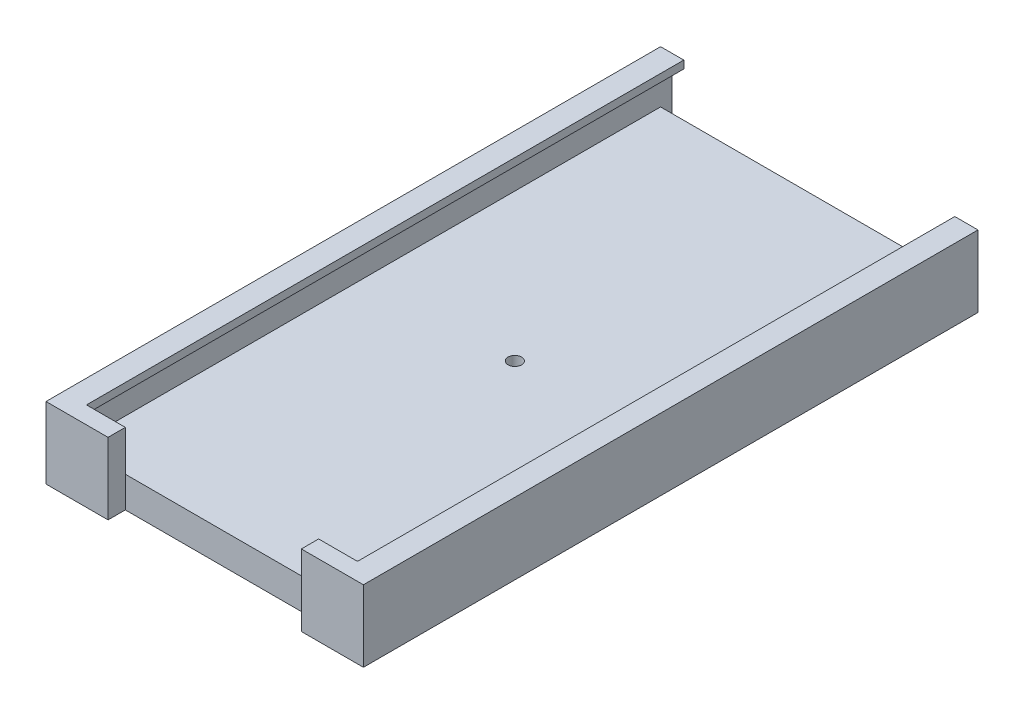
ISO-10303-21;
HEADER;
FILE_DESCRIPTION(('STEP AP214'),'2;1');
FILE_NAME('part.step','',(''),(''),'','','');
FILE_SCHEMA(('AUTOMOTIVE_DESIGN { 1 0 10303 214 1 1 1 1 }'));
ENDSEC;
DATA;
#1=APPLICATION_CONTEXT('core data for automotive mechanical design processes');
#2=APPLICATION_PROTOCOL_DEFINITION('international standard','automotive_design',2000,#1);
#3=PRODUCT_CONTEXT('',#1,'mechanical');
#4=PRODUCT('Part','Part','',(#3));
#5=PRODUCT_RELATED_PRODUCT_CATEGORY('part','',(#4));
#6=PRODUCT_DEFINITION_FORMATION('','',#4);
#7=PRODUCT_DEFINITION_CONTEXT('part definition',#1,'design');
#8=PRODUCT_DEFINITION('design','',#6,#7);
#9=PRODUCT_DEFINITION_SHAPE('','',#8);
#10=(LENGTH_UNIT() NAMED_UNIT(*) SI_UNIT(.MILLI.,.METRE.));
#11=(NAMED_UNIT(*) PLANE_ANGLE_UNIT() SI_UNIT($,.RADIAN.));
#12=(NAMED_UNIT(*) SI_UNIT($,.STERADIAN.) SOLID_ANGLE_UNIT());
#13=UNCERTAINTY_MEASURE_WITH_UNIT(LENGTH_MEASURE(1.E-05),#10,'distance_accuracy_value','');
#14=(GEOMETRIC_REPRESENTATION_CONTEXT(3) GLOBAL_UNCERTAINTY_ASSIGNED_CONTEXT((#13)) GLOBAL_UNIT_ASSIGNED_CONTEXT((#10,
#11,#12)) REPRESENTATION_CONTEXT('',''));
#15=CARTESIAN_POINT('',(0.,0.,0.));
#16=DIRECTION('',(0.,0.,1.));
#17=DIRECTION('',(1.,0.,0.));
#18=AXIS2_PLACEMENT_3D('',#15,#16,#17);
#19=CARTESIAN_POINT('',(0.,18.5,151.5));
#20=DIRECTION('',(0.,0.,1.));
#21=DIRECTION('',(1.,0.,0.));
#22=AXIS2_PLACEMENT_3D('',#19,#20,#21);
#23=PLANE('',#22);
#24=DIRECTION('',(1.,0.,0.));
#25=VECTOR('',#24,1.);
#26=CARTESIAN_POINT('',(73.1,16.5,151.5));
#27=LINE('',#26,#25);
#28=CARTESIAN_POINT('',(73.1,16.5,151.5));
#29=VERTEX_POINT('',#28);
#30=CARTESIAN_POINT('',(76.1,16.5,151.5));
#31=VERTEX_POINT('',#30);
#32=EDGE_CURVE('E118',#29,#31,#27,.T.);
#33=ORIENTED_EDGE('',*,*,#32,.T.);
#34=DIRECTION('',(0.,-1.,0.));
#35=VECTOR('',#34,1.);
#36=CARTESIAN_POINT('',(76.1,18.5,151.5));
#37=LINE('',#36,#35);
#38=CARTESIAN_POINT('',(76.1,8.,151.5));
#39=VERTEX_POINT('',#38);
#40=EDGE_CURVE('E347',#31,#39,#37,.T.);
#41=ORIENTED_EDGE('',*,*,#40,.T.);
#42=DIRECTION('',(1.,0.,0.));
#43=VECTOR('',#42,1.);
#44=CARTESIAN_POINT('',(0.,8.,151.5));
#45=LINE('',#44,#43);
#46=CARTESIAN_POINT('',(63.05,8.,151.5));
#47=VERTEX_POINT('',#46);
#48=EDGE_CURVE('E364',#47,#39,#45,.T.);
#49=ORIENTED_EDGE('',*,*,#48,.F.);
#50=DIRECTION('',(0.,-1.,0.));
#51=VECTOR('',#50,1.);
#52=CARTESIAN_POINT('',(63.05,24.5,151.5));
#53=LINE('',#52,#51);
#54=CARTESIAN_POINT('',(63.05,18.5,151.5));
#55=VERTEX_POINT('',#54);
#56=EDGE_CURVE('E308',#55,#47,#53,.T.);
#57=ORIENTED_EDGE('',*,*,#56,.F.);
#58=DIRECTION('',(-1.,0.,0.));
#59=VECTOR('',#58,1.);
#60=CARTESIAN_POINT('',(0.,18.5,151.5));
#61=LINE('',#60,#59);
#62=CARTESIAN_POINT('',(73.1,18.5,151.5));
#63=VERTEX_POINT('',#62);
#64=EDGE_CURVE('E239',#63,#55,#61,.T.);
#65=ORIENTED_EDGE('',*,*,#64,.F.);
#66=DIRECTION('',(0.,1.,0.));
#67=VECTOR('',#66,1.);
#68=CARTESIAN_POINT('',(73.1,18.5,151.5));
#69=LINE('',#68,#67);
#70=EDGE_CURVE('E113',#29,#63,#69,.T.);
#71=ORIENTED_EDGE('',*,*,#70,.F.);
#72=EDGE_LOOP('',(#33,#41,#49,#57,#65,#71));
#73=FACE_BOUND('',#72,.T.);
#74=ADVANCED_FACE('F97',(#73),#23,.F.);
#75=CARTESIAN_POINT('',(76.1,18.5,0.));
#76=DIRECTION('',(-1.,0.,0.));
#77=DIRECTION('',(0.,0.,1.));
#78=AXIS2_PLACEMENT_3D('',#75,#76,#77);
#79=PLANE('',#78);
#80=ORIENTED_EDGE('',*,*,#40,.F.);
#81=DIRECTION('',(0.,0.,1.));
#82=VECTOR('',#81,1.);
#83=CARTESIAN_POINT('',(76.1,16.5,151.5));
#84=LINE('',#83,#82);
#85=CARTESIAN_POINT('',(76.1,16.5,-3.));
#86=VERTEX_POINT('',#85);
#87=EDGE_CURVE('E256',#86,#31,#84,.T.);
#88=ORIENTED_EDGE('',*,*,#87,.F.);
#89=DIRECTION('',(0.,1.,0.));
#90=VECTOR('',#89,1.);
#91=CARTESIAN_POINT('',(76.1,2.,-3.));
#92=LINE('',#91,#90);
#93=CARTESIAN_POINT('',(76.1,2.,-3.));
#94=VERTEX_POINT('',#93);
#95=EDGE_CURVE('E293',#94,#86,#92,.T.);
#96=ORIENTED_EDGE('',*,*,#95,.F.);
#97=DIRECTION('',(0.,0.,-1.));
#98=VECTOR('',#97,1.);
#99=CARTESIAN_POINT('',(76.1,2.,0.));
#100=LINE('',#99,#98);
#101=CARTESIAN_POINT('',(76.1,2.,0.));
#102=VERTEX_POINT('',#101);
#103=EDGE_CURVE('E289',#102,#94,#100,.T.);
#104=ORIENTED_EDGE('',*,*,#103,.F.);
#105=DIRECTION('',(0.,1.,0.));
#106=VECTOR('',#105,1.);
#107=CARTESIAN_POINT('',(76.1,2.,0.));
#108=LINE('',#107,#106);
#109=CARTESIAN_POINT('',(76.1,8.,0.));
#110=VERTEX_POINT('',#109);
#111=EDGE_CURVE('E296',#102,#110,#108,.T.);
#112=ORIENTED_EDGE('',*,*,#111,.T.);
#113=DIRECTION('',(0.,0.,1.));
#114=VECTOR('',#113,1.);
#115=CARTESIAN_POINT('',(76.1,8.,0.));
#116=LINE('',#115,#114);
#117=EDGE_CURVE('E354',#110,#39,#116,.T.);
#118=ORIENTED_EDGE('',*,*,#117,.T.);
#119=EDGE_LOOP('',(#80,#88,#96,#104,#112,#118));
#120=FACE_BOUND('',#119,.T.);
#121=ADVANCED_FACE('F437',(#120),#79,.T.);
#122=CARTESIAN_POINT('',(0.,18.5,0.));
#123=DIRECTION('',(1.,0.,0.));
#124=DIRECTION('',(0.,0.,-1.));
#125=AXIS2_PLACEMENT_3D('',#122,#123,#124);
#126=PLANE('',#125);
#127=DIRECTION('',(0.,1.,0.));
#128=VECTOR('',#127,1.);
#129=CARTESIAN_POINT('',(0.,2.,-3.));
#130=LINE('',#129,#128);
#131=CARTESIAN_POINT('',(0.,2.,-3.));
#132=VERTEX_POINT('',#131);
#133=CARTESIAN_POINT('',(0.,16.5,-3.));
#134=VERTEX_POINT('',#133);
#135=EDGE_CURVE('E292',#132,#134,#130,.T.);
#136=ORIENTED_EDGE('',*,*,#135,.T.);
#137=DIRECTION('',(0.,0.,-1.));
#138=VECTOR('',#137,1.);
#139=CARTESIAN_POINT('',(0.,16.5,-3.));
#140=LINE('',#139,#138);
#141=CARTESIAN_POINT('',(0.,16.5,151.5));
#142=VERTEX_POINT('',#141);
#143=EDGE_CURVE('E262',#142,#134,#140,.T.);
#144=ORIENTED_EDGE('',*,*,#143,.F.);
#145=DIRECTION('',(0.,-1.,0.));
#146=VECTOR('',#145,1.);
#147=CARTESIAN_POINT('',(0.,18.5,151.5));
#148=LINE('',#147,#146);
#149=CARTESIAN_POINT('',(0.,8.,151.5));
#150=VERTEX_POINT('',#149);
#151=EDGE_CURVE('E331',#142,#150,#148,.T.);
#152=ORIENTED_EDGE('',*,*,#151,.T.);
#153=DIRECTION('',(0.,0.,1.));
#154=VECTOR('',#153,1.);
#155=CARTESIAN_POINT('',(0.,8.,0.));
#156=LINE('',#155,#154);
#157=CARTESIAN_POINT('',(0.,8.,0.));
#158=VERTEX_POINT('',#157);
#159=EDGE_CURVE('E361',#158,#150,#156,.T.);
#160=ORIENTED_EDGE('',*,*,#159,.F.);
#161=DIRECTION('',(0.,1.,0.));
#162=VECTOR('',#161,1.);
#163=CARTESIAN_POINT('',(0.,2.,0.));
#164=LINE('',#163,#162);
#165=CARTESIAN_POINT('',(0.,2.,0.));
#166=VERTEX_POINT('',#165);
#167=EDGE_CURVE('E299',#166,#158,#164,.T.);
#168=ORIENTED_EDGE('',*,*,#167,.F.);
#169=DIRECTION('',(0.,0.,-1.));
#170=VECTOR('',#169,1.);
#171=CARTESIAN_POINT('',(0.,2.,0.));
#172=LINE('',#171,#170);
#173=EDGE_CURVE('E285',#166,#132,#172,.T.);
#174=ORIENTED_EDGE('',*,*,#173,.T.);
#175=EDGE_LOOP('',(#136,#144,#152,#160,#168,#174));
#176=FACE_BOUND('',#175,.T.);
#177=ADVANCED_FACE('F442',(#176),#126,.T.);
#178=DIRECTION('',(-1.,0.,0.));
#179=VECTOR('',#178,1.);
#180=CARTESIAN_POINT('',(3.00000000000002,16.5,151.5));
#181=LINE('',#180,#179);
#182=CARTESIAN_POINT('',(3.00000000000002,16.5,151.5));
#183=VERTEX_POINT('',#182);
#184=EDGE_CURVE('E279',#183,#142,#181,.T.);
#185=ORIENTED_EDGE('',*,*,#184,.F.);
#186=DIRECTION('',(0.,-1.,0.));
#187=VECTOR('',#186,1.);
#188=CARTESIAN_POINT('',(3.00000000000002,18.5,151.5));
#189=LINE('',#188,#187);
#190=CARTESIAN_POINT('',(3.00000000000002,18.5,151.5));
#191=VERTEX_POINT('',#190);
#192=EDGE_CURVE('E269',#191,#183,#189,.T.);
#193=ORIENTED_EDGE('',*,*,#192,.F.);
#194=CARTESIAN_POINT('',(13.05,18.5,151.5));
#195=VERTEX_POINT('',#194);
#196=EDGE_CURVE('E321',#195,#191,#61,.T.);
#197=ORIENTED_EDGE('',*,*,#196,.F.);
#198=DIRECTION('',(0.,-1.,0.));
#199=VECTOR('',#198,1.);
#200=CARTESIAN_POINT('',(13.05,24.5,151.5));
#201=LINE('',#200,#199);
#202=CARTESIAN_POINT('',(13.05,8.,151.5));
#203=VERTEX_POINT('',#202);
#204=EDGE_CURVE('E304',#195,#203,#201,.T.);
#205=ORIENTED_EDGE('',*,*,#204,.T.);
#206=EDGE_CURVE('E365',#150,#203,#45,.T.);
#207=ORIENTED_EDGE('',*,*,#206,.F.);
#208=ORIENTED_EDGE('',*,*,#151,.F.);
#209=EDGE_LOOP('',(#185,#193,#197,#205,#207,#208));
#210=FACE_BOUND('',#209,.T.);
#211=ADVANCED_FACE('F396',(#210),#23,.F.);
#212=CARTESIAN_POINT('',(0.,18.5,0.));
#213=DIRECTION('',(0.,1.,0.));
#214=DIRECTION('',(0.,0.,1.));
#215=AXIS2_PLACEMENT_3D('',#212,#213,#214);
#216=PLANE('',#215);
#217=DIRECTION('',(0.,0.,1.));
#218=VECTOR('',#217,1.);
#219=CARTESIAN_POINT('',(3.,18.5,-3.));
#220=LINE('',#219,#218);
#221=CARTESIAN_POINT('',(3.,18.5,-3.));
#222=VERTEX_POINT('',#221);
#223=EDGE_CURVE('E266',#222,#191,#220,.T.);
#224=ORIENTED_EDGE('',*,*,#223,.F.);
#225=DIRECTION('',(1.,0.,0.));
#226=VECTOR('',#225,1.);
#227=CARTESIAN_POINT('',(0.,18.5,-3.));
#228=LINE('',#227,#226);
#229=CARTESIAN_POINT('',(-3.,18.5,-3.));
#230=VERTEX_POINT('',#229);
#231=EDGE_CURVE('E238',#230,#222,#228,.T.);
#232=ORIENTED_EDGE('',*,*,#231,.F.);
#233=DIRECTION('',(0.,0.,1.));
#234=VECTOR('',#233,1.);
#235=CARTESIAN_POINT('',(-2.99999999999998,18.5,0.));
#236=LINE('',#235,#234);
#237=CARTESIAN_POINT('',(-2.99999999999998,18.5,155.969932389917));
#238=VERTEX_POINT('',#237);
#239=EDGE_CURVE('E323',#230,#238,#236,.T.);
#240=ORIENTED_EDGE('',*,*,#239,.T.);
#241=DIRECTION('',(-1.,0.,0.));
#242=VECTOR('',#241,1.);
#243=CARTESIAN_POINT('',(0.,18.5,155.969932389917));
#244=LINE('',#243,#242);
#245=CARTESIAN_POINT('',(13.05,18.5,155.969932389917));
#246=VERTEX_POINT('',#245);
#247=EDGE_CURVE('E326',#246,#238,#244,.T.);
#248=ORIENTED_EDGE('',*,*,#247,.F.);
#249=DIRECTION('',(0.,0.,1.));
#250=VECTOR('',#249,1.);
#251=CARTESIAN_POINT('',(13.05,18.5,0.));
#252=LINE('',#251,#250);
#253=EDGE_CURVE('E311',#195,#246,#252,.T.);
#254=ORIENTED_EDGE('',*,*,#253,.F.);
#255=ORIENTED_EDGE('',*,*,#196,.T.);
#256=EDGE_LOOP('',(#224,#232,#240,#248,#254,#255));
#257=FACE_BOUND('',#256,.T.);
#258=ADVANCED_FACE('F401',(#257),#216,.T.);
#259=CARTESIAN_POINT('',(0.,18.5,155.969932389917));
#260=DIRECTION('',(0.,0.,1.));
#261=DIRECTION('',(1.,0.,0.));
#262=AXIS2_PLACEMENT_3D('',#259,#260,#261);
#263=PLANE('',#262);
#264=DIRECTION('',(0.,1.,0.));
#265=VECTOR('',#264,1.);
#266=CARTESIAN_POINT('',(63.05,18.5,155.969932389917));
#267=LINE('',#266,#265);
#268=CARTESIAN_POINT('',(63.05,0.,155.969932389917));
#269=VERTEX_POINT('',#268);
#270=CARTESIAN_POINT('',(63.05,18.5,155.969932389917));
#271=VERTEX_POINT('',#270);
#272=EDGE_CURVE('E315',#269,#271,#267,.T.);
#273=ORIENTED_EDGE('',*,*,#272,.F.);
#274=DIRECTION('',(-1.,0.,0.));
#275=VECTOR('',#274,1.);
#276=CARTESIAN_POINT('',(0.,0.,155.969932389917));
#277=LINE('',#276,#275);
#278=CARTESIAN_POINT('',(79.1,0.,155.969932389917));
#279=VERTEX_POINT('',#278);
#280=EDGE_CURVE('E338',#279,#269,#277,.T.);
#281=ORIENTED_EDGE('',*,*,#280,.F.);
#282=DIRECTION('',(0.,-1.,0.));
#283=VECTOR('',#282,1.);
#284=CARTESIAN_POINT('',(79.1,18.5,155.969932389917));
#285=LINE('',#284,#283);
#286=CARTESIAN_POINT('',(79.1,18.5,155.969932389917));
#287=VERTEX_POINT('',#286);
#288=EDGE_CURVE('E346',#287,#279,#285,.T.);
#289=ORIENTED_EDGE('',*,*,#288,.F.);
#290=EDGE_CURVE('E327',#287,#271,#244,.T.);
#291=ORIENTED_EDGE('',*,*,#290,.T.);
#292=EDGE_LOOP('',(#273,#281,#289,#291));
#293=FACE_BOUND('',#292,.T.);
#294=ADVANCED_FACE('F424',(#293),#263,.T.);
#295=CARTESIAN_POINT('',(0.,8.,0.));
#296=DIRECTION('',(0.,1.,0.));
#297=DIRECTION('',(0.,0.,1.));
#298=AXIS2_PLACEMENT_3D('',#295,#296,#297);
#299=PLANE('',#298);
#300=CARTESIAN_POINT('',(38.05,8.,75.75));
#301=DIRECTION('',(0.,1.,0.));
#302=DIRECTION('',(0.,0.,1.));
#303=AXIS2_PLACEMENT_3D('',#300,#301,#302);
#304=CIRCLE('',#303,1.75);
#305=CARTESIAN_POINT('',(38.05,8.,77.5));
#306=VERTEX_POINT('',#305);
#307=EDGE_CURVE('E259',#306,#306,#304,.F.);
#308=ORIENTED_EDGE('',*,*,#307,.T.);
#309=EDGE_LOOP('',(#308));
#310=FACE_BOUND('',#309,.T.);
#311=ORIENTED_EDGE('',*,*,#117,.F.);
#312=DIRECTION('',(1.,0.,0.));
#313=VECTOR('',#312,1.);
#314=CARTESIAN_POINT('',(0.,8.,0.));
#315=LINE('',#314,#313);
#316=EDGE_CURVE('E359',#158,#110,#315,.T.);
#317=ORIENTED_EDGE('',*,*,#316,.F.);
#318=ORIENTED_EDGE('',*,*,#159,.T.);
#319=ORIENTED_EDGE('',*,*,#206,.T.);
#320=DIRECTION('',(-1.,0.,0.));
#321=VECTOR('',#320,1.);
#322=CARTESIAN_POINT('',(0.,8.,151.5));
#323=LINE('',#322,#321);
#324=EDGE_CURVE('E313',#47,#203,#323,.T.);
#325=ORIENTED_EDGE('',*,*,#324,.F.);
#326=ORIENTED_EDGE('',*,*,#48,.T.);
#327=EDGE_LOOP('',(#311,#317,#318,#319,#325,#326));
#328=FACE_BOUND('',#327,.T.);
#329=ADVANCED_FACE('F388',(#310,#328),#299,.T.);
#330=CARTESIAN_POINT('',(0.,18.5,-3.));
#331=DIRECTION('',(0.,0.,-1.));
#332=DIRECTION('',(-1.,0.,0.));
#333=AXIS2_PLACEMENT_3D('',#330,#331,#332);
#334=PLANE('',#333);
#335=ORIENTED_EDGE('',*,*,#95,.T.);
#336=DIRECTION('',(1.,0.,0.));
#337=VECTOR('',#336,1.);
#338=CARTESIAN_POINT('',(73.1,16.5,-3.));
#339=LINE('',#338,#337);
#340=CARTESIAN_POINT('',(73.1,16.5,-3.));
#341=VERTEX_POINT('',#340);
#342=EDGE_CURVE('E249',#341,#86,#339,.T.);
#343=ORIENTED_EDGE('',*,*,#342,.F.);
#344=DIRECTION('',(0.,-1.,0.));
#345=VECTOR('',#344,1.);
#346=CARTESIAN_POINT('',(73.1,18.5,-3.));
#347=LINE('',#346,#345);
#348=CARTESIAN_POINT('',(73.1,18.5,-3.));
#349=VERTEX_POINT('',#348);
#350=EDGE_CURVE('E243',#349,#341,#347,.T.);
#351=ORIENTED_EDGE('',*,*,#350,.F.);
#352=CARTESIAN_POINT('',(79.1,18.5,-3.));
#353=VERTEX_POINT('',#352);
#354=EDGE_CURVE('E228',#349,#353,#228,.T.);
#355=ORIENTED_EDGE('',*,*,#354,.T.);
#356=DIRECTION('',(0.,-1.,0.));
#357=VECTOR('',#356,1.);
#358=CARTESIAN_POINT('',(79.1,18.5,-3.));
#359=LINE('',#358,#357);
#360=CARTESIAN_POINT('',(79.1,0.,-3.));
#361=VERTEX_POINT('',#360);
#362=EDGE_CURVE('E344',#353,#361,#359,.T.);
#363=ORIENTED_EDGE('',*,*,#362,.T.);
#364=DIRECTION('',(1.,0.,0.));
#365=VECTOR('',#364,1.);
#366=CARTESIAN_POINT('',(0.,0.,-3.));
#367=LINE('',#366,#365);
#368=CARTESIAN_POINT('',(-3.,0.,-3.));
#369=VERTEX_POINT('',#368);
#370=EDGE_CURVE('E320',#369,#361,#367,.T.);
#371=ORIENTED_EDGE('',*,*,#370,.F.);
#372=DIRECTION('',(0.,-1.,0.));
#373=VECTOR('',#372,1.);
#374=CARTESIAN_POINT('',(-3.,18.5,-3.));
#375=LINE('',#374,#373);
#376=EDGE_CURVE('E352',#230,#369,#375,.T.);
#377=ORIENTED_EDGE('',*,*,#376,.F.);
#378=ORIENTED_EDGE('',*,*,#231,.T.);
#379=DIRECTION('',(0.,1.,0.));
#380=VECTOR('',#379,1.);
#381=CARTESIAN_POINT('',(3.,18.5,-3.));
#382=LINE('',#381,#380);
#383=CARTESIAN_POINT('',(3.,16.5,-3.));
#384=VERTEX_POINT('',#383);
#385=EDGE_CURVE('E263',#384,#222,#382,.T.);
#386=ORIENTED_EDGE('',*,*,#385,.F.);
#387=DIRECTION('',(-1.,0.,0.));
#388=VECTOR('',#387,1.);
#389=CARTESIAN_POINT('',(3.,16.5,-3.));
#390=LINE('',#389,#388);
#391=EDGE_CURVE('E274',#384,#134,#390,.T.);
#392=ORIENTED_EDGE('',*,*,#391,.T.);
#393=ORIENTED_EDGE('',*,*,#135,.F.);
#394=DIRECTION('',(-1.,0.,0.));
#395=VECTOR('',#394,1.);
#396=CARTESIAN_POINT('',(76.1,2.,-3.));
#397=LINE('',#396,#395);
#398=EDGE_CURVE('E282',#94,#132,#397,.T.);
#399=ORIENTED_EDGE('',*,*,#398,.F.);
#400=EDGE_LOOP('',(#335,#343,#351,#355,#363,#371,#377,#378,#386,#392,#393,#399));
#401=FACE_BOUND('',#400,.T.);
#402=ADVANCED_FACE('F247',(#401),#334,.T.);
#403=CARTESIAN_POINT('',(-2.99999999999998,18.5,0.));
#404=DIRECTION('',(1.,0.,0.));
#405=DIRECTION('',(0.,0.,-1.));
#406=AXIS2_PLACEMENT_3D('',#403,#404,#405);
#407=PLANE('',#406);
#408=DIRECTION('',(0.,0.,1.));
#409=VECTOR('',#408,1.);
#410=CARTESIAN_POINT('',(-2.99999999999998,0.,0.));
#411=LINE('',#410,#409);
#412=CARTESIAN_POINT('',(-2.99999999999998,0.,155.969932389917));
#413=VERTEX_POINT('',#412);
#414=EDGE_CURVE('E334',#369,#413,#411,.T.);
#415=ORIENTED_EDGE('',*,*,#414,.T.);
#416=DIRECTION('',(0.,-1.,0.));
#417=VECTOR('',#416,1.);
#418=CARTESIAN_POINT('',(-2.99999999999998,18.5,155.969932389917));
#419=LINE('',#418,#417);
#420=EDGE_CURVE('E349',#238,#413,#419,.T.);
#421=ORIENTED_EDGE('',*,*,#420,.F.);
#422=ORIENTED_EDGE('',*,*,#239,.F.);
#423=ORIENTED_EDGE('',*,*,#376,.T.);
#424=EDGE_LOOP('',(#415,#421,#422,#423));
#425=FACE_BOUND('',#424,.T.);
#426=ADVANCED_FACE('F414',(#425),#407,.F.);
#427=DIRECTION('',(0.,-1.,0.));
#428=VECTOR('',#427,1.);
#429=CARTESIAN_POINT('',(13.05,18.5,155.969932389917));
#430=LINE('',#429,#428);
#431=CARTESIAN_POINT('',(13.05,0.,155.969932389917));
#432=VERTEX_POINT('',#431);
#433=EDGE_CURVE('E309',#246,#432,#430,.T.);
#434=ORIENTED_EDGE('',*,*,#433,.F.);
#435=ORIENTED_EDGE('',*,*,#247,.T.);
#436=ORIENTED_EDGE('',*,*,#420,.T.);
#437=EDGE_CURVE('E337',#432,#413,#277,.T.);
#438=ORIENTED_EDGE('',*,*,#437,.F.);
#439=EDGE_LOOP('',(#434,#435,#436,#438));
#440=FACE_BOUND('',#439,.T.);
#441=ADVANCED_FACE('F418',(#440),#263,.T.);
#442=CARTESIAN_POINT('',(79.1,18.5,0.));
#443=DIRECTION('',(1.,0.,0.));
#444=DIRECTION('',(0.,0.,-1.));
#445=AXIS2_PLACEMENT_3D('',#442,#443,#444);
#446=PLANE('',#445);
#447=DIRECTION('',(0.,0.,1.));
#448=VECTOR('',#447,1.);
#449=CARTESIAN_POINT('',(79.1,0.,0.));
#450=LINE('',#449,#448);
#451=EDGE_CURVE('E341',#361,#279,#450,.T.);
#452=ORIENTED_EDGE('',*,*,#451,.F.);
#453=ORIENTED_EDGE('',*,*,#362,.F.);
#454=DIRECTION('',(0.,0.,1.));
#455=VECTOR('',#454,1.);
#456=CARTESIAN_POINT('',(79.1,18.5,0.));
#457=LINE('',#456,#455);
#458=EDGE_CURVE('E234',#353,#287,#457,.T.);
#459=ORIENTED_EDGE('',*,*,#458,.T.);
#460=ORIENTED_EDGE('',*,*,#288,.T.);
#461=EDGE_LOOP('',(#452,#453,#459,#460));
#462=FACE_BOUND('',#461,.T.);
#463=ADVANCED_FACE('F421',(#462),#446,.T.);
#464=DIRECTION('',(0.,0.,-1.));
#465=VECTOR('',#464,1.);
#466=CARTESIAN_POINT('',(73.1,18.5,151.5));
#467=LINE('',#466,#465);
#468=EDGE_CURVE('E231',#63,#349,#467,.T.);
#469=ORIENTED_EDGE('',*,*,#468,.F.);
#470=ORIENTED_EDGE('',*,*,#64,.T.);
#471=DIRECTION('',(0.,0.,-1.));
#472=VECTOR('',#471,1.);
#473=CARTESIAN_POINT('',(63.05,18.5,0.));
#474=LINE('',#473,#472);
#475=EDGE_CURVE('E317',#271,#55,#474,.T.);
#476=ORIENTED_EDGE('',*,*,#475,.F.);
#477=ORIENTED_EDGE('',*,*,#290,.F.);
#478=ORIENTED_EDGE('',*,*,#458,.F.);
#479=ORIENTED_EDGE('',*,*,#354,.F.);
#480=EDGE_LOOP('',(#469,#470,#476,#477,#478,#479));
#481=FACE_BOUND('',#480,.T.);
#482=ADVANCED_FACE('F230',(#481),#216,.T.);
#483=CARTESIAN_POINT('',(0.,0.,0.));
#484=DIRECTION('',(0.,1.,0.));
#485=DIRECTION('',(0.,0.,1.));
#486=AXIS2_PLACEMENT_3D('',#483,#484,#485);
#487=PLANE('',#486);
#488=CARTESIAN_POINT('',(38.05,0.,75.75));
#489=DIRECTION('',(0.,1.,0.));
#490=DIRECTION('',(0.,0.,1.));
#491=AXIS2_PLACEMENT_3D('',#488,#489,#490);
#492=CIRCLE('',#491,1.75);
#493=CARTESIAN_POINT('',(38.05,0.,77.5));
#494=VERTEX_POINT('',#493);
#495=EDGE_CURVE('E101',#494,#494,#492,.F.);
#496=ORIENTED_EDGE('',*,*,#495,.F.);
#497=EDGE_LOOP('',(#496));
#498=FACE_BOUND('',#497,.T.);
#499=ORIENTED_EDGE('',*,*,#280,.T.);
#500=DIRECTION('',(0.,0.,-1.));
#501=VECTOR('',#500,1.);
#502=CARTESIAN_POINT('',(63.05,0.,0.));
#503=LINE('',#502,#501);
#504=CARTESIAN_POINT('',(63.05,0.,151.5));
#505=VERTEX_POINT('',#504);
#506=EDGE_CURVE('E12',#269,#505,#503,.T.);
#507=ORIENTED_EDGE('',*,*,#506,.T.);
#508=DIRECTION('',(-1.,0.,0.));
#509=VECTOR('',#508,1.);
#510=CARTESIAN_POINT('',(0.,0.,151.5));
#511=LINE('',#510,#509);
#512=CARTESIAN_POINT('',(13.05,0.,151.5));
#513=VERTEX_POINT('',#512);
#514=EDGE_CURVE('E106',#505,#513,#511,.T.);
#515=ORIENTED_EDGE('',*,*,#514,.T.);
#516=DIRECTION('',(0.,0.,1.));
#517=VECTOR('',#516,1.);
#518=CARTESIAN_POINT('',(13.05,0.,0.));
#519=LINE('',#518,#517);
#520=EDGE_CURVE('E368',#513,#432,#519,.T.);
#521=ORIENTED_EDGE('',*,*,#520,.T.);
#522=ORIENTED_EDGE('',*,*,#437,.T.);
#523=ORIENTED_EDGE('',*,*,#414,.F.);
#524=ORIENTED_EDGE('',*,*,#370,.T.);
#525=ORIENTED_EDGE('',*,*,#451,.T.);
#526=EDGE_LOOP('',(#499,#507,#515,#521,#522,#523,#524,#525));
#527=FACE_BOUND('',#526,.T.);
#528=ADVANCED_FACE('F99',(#498,#527),#487,.F.);
#529=CARTESIAN_POINT('',(38.05,24.5,151.5));
#530=DIRECTION('',(0.,0.,-1.));
#531=DIRECTION('',(-1.,0.,0.));
#532=AXIS2_PLACEMENT_3D('',#529,#530,#531);
#533=PLANE('',#532);
#534=ORIENTED_EDGE('',*,*,#324,.T.);
#535=EDGE_CURVE('E295',#203,#513,#201,.T.);
#536=ORIENTED_EDGE('',*,*,#535,.T.);
#537=ORIENTED_EDGE('',*,*,#514,.F.);
#538=EDGE_CURVE('E305',#47,#505,#53,.T.);
#539=ORIENTED_EDGE('',*,*,#538,.F.);
#540=EDGE_LOOP('',(#534,#536,#537,#539));
#541=FACE_BOUND('',#540,.T.);
#542=ADVANCED_FACE('F375',(#541),#533,.F.);
#543=CARTESIAN_POINT('',(63.05,24.5,151.5));
#544=DIRECTION('',(1.,0.,0.));
#545=DIRECTION('',(0.,0.,-1.));
#546=AXIS2_PLACEMENT_3D('',#543,#544,#545);
#547=PLANE('',#546);
#548=ORIENTED_EDGE('',*,*,#475,.T.);
#549=ORIENTED_EDGE('',*,*,#56,.T.);
#550=ORIENTED_EDGE('',*,*,#538,.T.);
#551=ORIENTED_EDGE('',*,*,#506,.F.);
#552=ORIENTED_EDGE('',*,*,#272,.T.);
#553=EDGE_LOOP('',(#548,#549,#550,#551,#552));
#554=FACE_BOUND('',#553,.T.);
#555=ADVANCED_FACE('F379',(#554),#547,.F.);
#556=CARTESIAN_POINT('',(13.05,24.5,161.5));
#557=DIRECTION('',(-1.,0.,0.));
#558=DIRECTION('',(0.,0.,1.));
#559=AXIS2_PLACEMENT_3D('',#556,#557,#558);
#560=PLANE('',#559);
#561=ORIENTED_EDGE('',*,*,#253,.T.);
#562=ORIENTED_EDGE('',*,*,#433,.T.);
#563=ORIENTED_EDGE('',*,*,#520,.F.);
#564=ORIENTED_EDGE('',*,*,#535,.F.);
#565=ORIENTED_EDGE('',*,*,#204,.F.);
#566=EDGE_LOOP('',(#561,#562,#563,#564,#565));
#567=FACE_BOUND('',#566,.T.);
#568=ADVANCED_FACE('F392',(#567),#560,.F.);
#569=CARTESIAN_POINT('',(76.1,2.,0.));
#570=DIRECTION('',(0.,0.,-1.));
#571=DIRECTION('',(-1.,0.,0.));
#572=AXIS2_PLACEMENT_3D('',#569,#570,#571);
#573=PLANE('',#572);
#574=ORIENTED_EDGE('',*,*,#111,.F.);
#575=DIRECTION('',(-1.,0.,0.));
#576=VECTOR('',#575,1.);
#577=CARTESIAN_POINT('',(76.1,2.,0.));
#578=LINE('',#577,#576);
#579=EDGE_CURVE('E287',#102,#166,#578,.T.);
#580=ORIENTED_EDGE('',*,*,#579,.T.);
#581=ORIENTED_EDGE('',*,*,#167,.T.);
#582=ORIENTED_EDGE('',*,*,#316,.T.);
#583=EDGE_LOOP('',(#574,#580,#581,#582));
#584=FACE_BOUND('',#583,.T.);
#585=ADVANCED_FACE('F462',(#584),#573,.T.);
#586=CARTESIAN_POINT('',(0.,2.,0.));
#587=DIRECTION('',(0.,-1.,0.));
#588=DIRECTION('',(0.,0.,-1.));
#589=AXIS2_PLACEMENT_3D('',#586,#587,#588);
#590=PLANE('',#589);
#591=ORIENTED_EDGE('',*,*,#398,.T.);
#592=ORIENTED_EDGE('',*,*,#173,.F.);
#593=ORIENTED_EDGE('',*,*,#579,.F.);
#594=ORIENTED_EDGE('',*,*,#103,.T.);
#595=EDGE_LOOP('',(#591,#592,#593,#594));
#596=FACE_BOUND('',#595,.T.);
#597=ADVANCED_FACE('F466',(#596),#590,.F.);
#598=CARTESIAN_POINT('',(3.,16.5,-3.));
#599=DIRECTION('',(0.,1.,0.));
#600=DIRECTION('',(0.,0.,1.));
#601=AXIS2_PLACEMENT_3D('',#598,#599,#600);
#602=PLANE('',#601);
#603=ORIENTED_EDGE('',*,*,#143,.T.);
#604=ORIENTED_EDGE('',*,*,#391,.F.);
#605=DIRECTION('',(0.,0.,-1.));
#606=VECTOR('',#605,1.);
#607=CARTESIAN_POINT('',(3.,16.5,-3.));
#608=LINE('',#607,#606);
#609=EDGE_CURVE('E272',#183,#384,#608,.T.);
#610=ORIENTED_EDGE('',*,*,#609,.F.);
#611=ORIENTED_EDGE('',*,*,#184,.T.);
#612=EDGE_LOOP('',(#603,#604,#610,#611));
#613=FACE_BOUND('',#612,.T.);
#614=ADVANCED_FACE('F458',(#613),#602,.F.);
#615=CARTESIAN_POINT('',(3.,0.,0.));
#616=DIRECTION('',(-1.,0.,0.));
#617=DIRECTION('',(0.,0.,1.));
#618=AXIS2_PLACEMENT_3D('',#615,#616,#617);
#619=PLANE('',#618);
#620=ORIENTED_EDGE('',*,*,#385,.T.);
#621=ORIENTED_EDGE('',*,*,#223,.T.);
#622=ORIENTED_EDGE('',*,*,#192,.T.);
#623=ORIENTED_EDGE('',*,*,#609,.T.);
#624=EDGE_LOOP('',(#620,#621,#622,#623));
#625=FACE_BOUND('',#624,.T.);
#626=ADVANCED_FACE('F405',(#625),#619,.F.);
#627=CARTESIAN_POINT('',(73.1,16.5,151.5));
#628=DIRECTION('',(0.,1.,0.));
#629=DIRECTION('',(0.,0.,1.));
#630=AXIS2_PLACEMENT_3D('',#627,#628,#629);
#631=PLANE('',#630);
#632=ORIENTED_EDGE('',*,*,#87,.T.);
#633=ORIENTED_EDGE('',*,*,#32,.F.);
#634=DIRECTION('',(0.,0.,1.));
#635=VECTOR('',#634,1.);
#636=CARTESIAN_POINT('',(73.1,16.5,151.5));
#637=LINE('',#636,#635);
#638=EDGE_CURVE('E251',#341,#29,#637,.T.);
#639=ORIENTED_EDGE('',*,*,#638,.F.);
#640=ORIENTED_EDGE('',*,*,#342,.T.);
#641=EDGE_LOOP('',(#632,#633,#639,#640));
#642=FACE_BOUND('',#641,.T.);
#643=ADVANCED_FACE('F468',(#642),#631,.F.);
#644=CARTESIAN_POINT('',(73.1,0.,0.));
#645=DIRECTION('',(1.,0.,0.));
#646=DIRECTION('',(0.,0.,-1.));
#647=AXIS2_PLACEMENT_3D('',#644,#645,#646);
#648=PLANE('',#647);
#649=ORIENTED_EDGE('',*,*,#70,.T.);
#650=ORIENTED_EDGE('',*,*,#468,.T.);
#651=ORIENTED_EDGE('',*,*,#350,.T.);
#652=ORIENTED_EDGE('',*,*,#638,.T.);
#653=EDGE_LOOP('',(#649,#650,#651,#652));
#654=FACE_BOUND('',#653,.T.);
#655=ADVANCED_FACE('F242',(#654),#648,.F.);
#656=CARTESIAN_POINT('',(38.05,11.,75.75));
#657=DIRECTION('',(0.,-1.,0.));
#658=DIRECTION('',(0.,0.,-1.));
#659=AXIS2_PLACEMENT_3D('',#656,#657,#658);
#660=CYLINDRICAL_SURFACE('',#659,1.75);
#661=ORIENTED_EDGE('',*,*,#307,.F.);
#662=EDGE_LOOP('',(#661));
#663=FACE_BOUND('',#662,.T.);
#664=ORIENTED_EDGE('',*,*,#495,.T.);
#665=EDGE_LOOP('',(#664));
#666=FACE_BOUND('',#665,.T.);
#667=ADVANCED_FACE('F475',(#663,#666),#660,.F.);
#668=CLOSED_SHELL('',(#74,#121,#177,#211,#258,#294,#329,#402,#426,#441,#463,#482,#528,#542,#555,
#568,#585,#597,#614,#626,#643,#655,#667));
#669=MANIFOLD_SOLID_BREP('B2',#668);
#670=ADVANCED_BREP_SHAPE_REPRESENTATION('',(#18,#669),#14);
#671=SHAPE_DEFINITION_REPRESENTATION(#9,#670);
ENDSEC;
END-ISO-10303-21;
